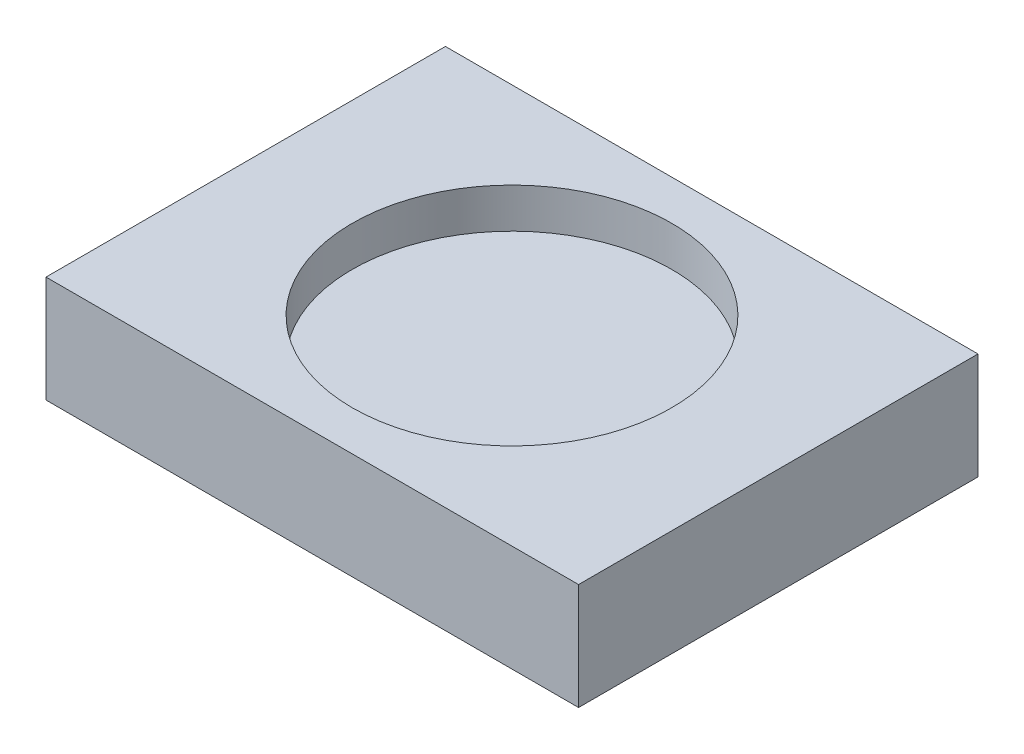
ISO-10303-21;
HEADER;
FILE_DESCRIPTION(('STEP AP214'),'2;1');
FILE_NAME('part.step','',(''),(''),'','','');
FILE_SCHEMA(('AUTOMOTIVE_DESIGN { 1 0 10303 214 1 1 1 1 }'));
ENDSEC;
DATA;
#1=APPLICATION_CONTEXT('core data for automotive mechanical design processes');
#2=APPLICATION_PROTOCOL_DEFINITION('international standard','automotive_design',2000,#1);
#3=PRODUCT_CONTEXT('',#1,'mechanical');
#4=PRODUCT('Part','Part','',(#3));
#5=PRODUCT_RELATED_PRODUCT_CATEGORY('part','',(#4));
#6=PRODUCT_DEFINITION_FORMATION('','',#4);
#7=PRODUCT_DEFINITION_CONTEXT('part definition',#1,'design');
#8=PRODUCT_DEFINITION('design','',#6,#7);
#9=PRODUCT_DEFINITION_SHAPE('','',#8);
#10=(LENGTH_UNIT() NAMED_UNIT(*) SI_UNIT(.MILLI.,.METRE.));
#11=(NAMED_UNIT(*) PLANE_ANGLE_UNIT() SI_UNIT($,.RADIAN.));
#12=(NAMED_UNIT(*) SI_UNIT($,.STERADIAN.) SOLID_ANGLE_UNIT());
#13=UNCERTAINTY_MEASURE_WITH_UNIT(LENGTH_MEASURE(1.E-05),#10,'distance_accuracy_value','');
#14=(GEOMETRIC_REPRESENTATION_CONTEXT(3) GLOBAL_UNCERTAINTY_ASSIGNED_CONTEXT((#13)) GLOBAL_UNIT_ASSIGNED_CONTEXT((#10,
#11,#12)) REPRESENTATION_CONTEXT('',''));
#15=CARTESIAN_POINT('',(0.,0.,0.));
#16=DIRECTION('',(0.,0.,1.));
#17=DIRECTION('',(1.,0.,0.));
#18=AXIS2_PLACEMENT_3D('',#15,#16,#17);
#19=CARTESIAN_POINT('',(100.,40.,-75.));
#20=DIRECTION('',(-1.,0.,0.));
#21=DIRECTION('',(0.,0.,1.));
#22=AXIS2_PLACEMENT_3D('',#19,#20,#21);
#23=PLANE('',#22);
#24=DIRECTION('',(0.,0.,-1.));
#25=VECTOR('',#24,1.);
#26=CARTESIAN_POINT('',(100.,0.,-75.));
#27=LINE('',#26,#25);
#28=CARTESIAN_POINT('',(100.,0.,75.));
#29=VERTEX_POINT('',#28);
#30=CARTESIAN_POINT('',(100.,0.,-75.));
#31=VERTEX_POINT('',#30);
#32=EDGE_CURVE('E98',#29,#31,#27,.T.);
#33=ORIENTED_EDGE('',*,*,#32,.T.);
#34=DIRECTION('',(0.,-1.,0.));
#35=VECTOR('',#34,1.);
#36=CARTESIAN_POINT('',(100.,40.,-75.));
#37=LINE('',#36,#35);
#38=CARTESIAN_POINT('',(100.,40.,-75.));
#39=VERTEX_POINT('',#38);
#40=EDGE_CURVE('E11',#39,#31,#37,.T.);
#41=ORIENTED_EDGE('',*,*,#40,.F.);
#42=DIRECTION('',(0.,0.,-1.));
#43=VECTOR('',#42,1.);
#44=CARTESIAN_POINT('',(100.,40.,-75.));
#45=LINE('',#44,#43);
#46=CARTESIAN_POINT('',(100.,40.,75.));
#47=VERTEX_POINT('',#46);
#48=EDGE_CURVE('E86',#47,#39,#45,.T.);
#49=ORIENTED_EDGE('',*,*,#48,.F.);
#50=DIRECTION('',(0.,-1.,0.));
#51=VECTOR('',#50,1.);
#52=CARTESIAN_POINT('',(100.,40.,75.));
#53=LINE('',#52,#51);
#54=EDGE_CURVE('E94',#47,#29,#53,.T.);
#55=ORIENTED_EDGE('',*,*,#54,.T.);
#56=EDGE_LOOP('',(#33,#41,#49,#55));
#57=FACE_BOUND('',#56,.T.);
#58=ADVANCED_FACE('F35',(#57),#23,.F.);
#59=CARTESIAN_POINT('',(-100.,40.,-75.));
#60=DIRECTION('',(0.,0.,1.));
#61=DIRECTION('',(1.,0.,0.));
#62=AXIS2_PLACEMENT_3D('',#59,#60,#61);
#63=PLANE('',#62);
#64=DIRECTION('',(-1.,0.,0.));
#65=VECTOR('',#64,1.);
#66=CARTESIAN_POINT('',(-100.,0.,-75.));
#67=LINE('',#66,#65);
#68=CARTESIAN_POINT('',(-100.,0.,-75.));
#69=VERTEX_POINT('',#68);
#70=EDGE_CURVE('E90',#31,#69,#67,.T.);
#71=ORIENTED_EDGE('',*,*,#70,.T.);
#72=DIRECTION('',(0.,-1.,0.));
#73=VECTOR('',#72,1.);
#74=CARTESIAN_POINT('',(-100.,40.,-75.));
#75=LINE('',#74,#73);
#76=CARTESIAN_POINT('',(-100.,40.,-75.));
#77=VERTEX_POINT('',#76);
#78=EDGE_CURVE('E43',#77,#69,#75,.T.);
#79=ORIENTED_EDGE('',*,*,#78,.F.);
#80=DIRECTION('',(-1.,0.,0.));
#81=VECTOR('',#80,1.);
#82=CARTESIAN_POINT('',(-100.,40.,-75.));
#83=LINE('',#82,#81);
#84=EDGE_CURVE('E81',#39,#77,#83,.T.);
#85=ORIENTED_EDGE('',*,*,#84,.F.);
#86=ORIENTED_EDGE('',*,*,#40,.T.);
#87=EDGE_LOOP('',(#71,#79,#85,#86));
#88=FACE_BOUND('',#87,.T.);
#89=ADVANCED_FACE('F89',(#88),#63,.F.);
#90=CARTESIAN_POINT('',(-100.,40.,-75.));
#91=DIRECTION('',(1.,0.,0.));
#92=DIRECTION('',(0.,0.,-1.));
#93=AXIS2_PLACEMENT_3D('',#90,#91,#92);
#94=PLANE('',#93);
#95=DIRECTION('',(0.,0.,1.));
#96=VECTOR('',#95,1.);
#97=CARTESIAN_POINT('',(-100.,0.,-75.));
#98=LINE('',#97,#96);
#99=CARTESIAN_POINT('',(-100.,0.,75.));
#100=VERTEX_POINT('',#99);
#101=EDGE_CURVE('E68',#69,#100,#98,.T.);
#102=ORIENTED_EDGE('',*,*,#101,.T.);
#103=DIRECTION('',(0.,-1.,0.));
#104=VECTOR('',#103,1.);
#105=CARTESIAN_POINT('',(-100.,40.,75.));
#106=LINE('',#105,#104);
#107=CARTESIAN_POINT('',(-100.,40.,75.));
#108=VERTEX_POINT('',#107);
#109=EDGE_CURVE('E91',#108,#100,#106,.T.);
#110=ORIENTED_EDGE('',*,*,#109,.F.);
#111=DIRECTION('',(0.,0.,1.));
#112=VECTOR('',#111,1.);
#113=CARTESIAN_POINT('',(-100.,40.,-75.));
#114=LINE('',#113,#112);
#115=EDGE_CURVE('E84',#77,#108,#114,.T.);
#116=ORIENTED_EDGE('',*,*,#115,.F.);
#117=ORIENTED_EDGE('',*,*,#78,.T.);
#118=EDGE_LOOP('',(#102,#110,#116,#117));
#119=FACE_BOUND('',#118,.T.);
#120=ADVANCED_FACE('F92',(#119),#94,.F.);
#121=CARTESIAN_POINT('',(-100.,40.,75.));
#122=DIRECTION('',(0.,0.,-1.));
#123=DIRECTION('',(-1.,0.,0.));
#124=AXIS2_PLACEMENT_3D('',#121,#122,#123);
#125=PLANE('',#124);
#126=DIRECTION('',(1.,0.,0.));
#127=VECTOR('',#126,1.);
#128=CARTESIAN_POINT('',(-100.,0.,75.));
#129=LINE('',#128,#127);
#130=EDGE_CURVE('E74',#100,#29,#129,.T.);
#131=ORIENTED_EDGE('',*,*,#130,.T.);
#132=ORIENTED_EDGE('',*,*,#54,.F.);
#133=DIRECTION('',(1.,0.,0.));
#134=VECTOR('',#133,1.);
#135=CARTESIAN_POINT('',(-100.,40.,75.));
#136=LINE('',#135,#134);
#137=EDGE_CURVE('E51',#108,#47,#136,.T.);
#138=ORIENTED_EDGE('',*,*,#137,.F.);
#139=ORIENTED_EDGE('',*,*,#109,.T.);
#140=EDGE_LOOP('',(#131,#132,#138,#139));
#141=FACE_BOUND('',#140,.T.);
#142=ADVANCED_FACE('F106',(#141),#125,.F.);
#143=CARTESIAN_POINT('',(0.,40.,0.));
#144=DIRECTION('',(0.,1.,0.));
#145=DIRECTION('',(0.,0.,1.));
#146=AXIS2_PLACEMENT_3D('',#143,#144,#145);
#147=PLANE('',#146);
#148=CARTESIAN_POINT('',(0.,40.,0.));
#149=DIRECTION('',(0.,1.,0.));
#150=DIRECTION('',(0.,0.,1.));
#151=AXIS2_PLACEMENT_3D('',#148,#149,#150);
#152=CIRCLE('',#151,60.);
#153=CARTESIAN_POINT('',(0.,40.,60.));
#154=VERTEX_POINT('',#153);
#155=EDGE_CURVE('E112',#154,#154,#152,.T.);
#156=ORIENTED_EDGE('',*,*,#155,.F.);
#157=EDGE_LOOP('',(#156));
#158=FACE_BOUND('',#157,.T.);
#159=ORIENTED_EDGE('',*,*,#48,.T.);
#160=ORIENTED_EDGE('',*,*,#84,.T.);
#161=ORIENTED_EDGE('',*,*,#115,.T.);
#162=ORIENTED_EDGE('',*,*,#137,.T.);
#163=EDGE_LOOP('',(#159,#160,#161,#162));
#164=FACE_BOUND('',#163,.T.);
#165=ADVANCED_FACE('F82',(#158,#164),#147,.T.);
#166=CARTESIAN_POINT('',(0.,0.,0.));
#167=DIRECTION('',(0.,1.,0.));
#168=DIRECTION('',(0.,0.,1.));
#169=AXIS2_PLACEMENT_3D('',#166,#167,#168);
#170=PLANE('',#169);
#171=ORIENTED_EDGE('',*,*,#32,.F.);
#172=ORIENTED_EDGE('',*,*,#130,.F.);
#173=ORIENTED_EDGE('',*,*,#101,.F.);
#174=ORIENTED_EDGE('',*,*,#70,.F.);
#175=EDGE_LOOP('',(#171,#172,#173,#174));
#176=FACE_BOUND('',#175,.T.);
#177=ADVANCED_FACE('F109',(#176),#170,.F.);
#178=CARTESIAN_POINT('',(0.,25.,0.));
#179=DIRECTION('',(0.,1.,0.));
#180=DIRECTION('',(0.,0.,1.));
#181=AXIS2_PLACEMENT_3D('',#178,#179,#180);
#182=CYLINDRICAL_SURFACE('',#181,60.);
#183=CARTESIAN_POINT('',(0.,25.,0.));
#184=DIRECTION('',(0.,1.,0.));
#185=DIRECTION('',(0.,0.,1.));
#186=AXIS2_PLACEMENT_3D('',#183,#184,#185);
#187=CIRCLE('',#186,60.);
#188=CARTESIAN_POINT('',(0.,25.,60.));
#189=VERTEX_POINT('',#188);
#190=EDGE_CURVE('E101',#189,#189,#187,.T.);
#191=ORIENTED_EDGE('',*,*,#190,.F.);
#192=EDGE_LOOP('',(#191));
#193=FACE_BOUND('',#192,.T.);
#194=ORIENTED_EDGE('',*,*,#155,.T.);
#195=EDGE_LOOP('',(#194));
#196=FACE_BOUND('',#195,.T.);
#197=ADVANCED_FACE('F120',(#193,#196),#182,.F.);
#198=CARTESIAN_POINT('',(0.,25.,0.));
#199=DIRECTION('',(0.,1.,0.));
#200=DIRECTION('',(0.,0.,1.));
#201=AXIS2_PLACEMENT_3D('',#198,#199,#200);
#202=PLANE('',#201);
#203=ORIENTED_EDGE('',*,*,#190,.T.);
#204=EDGE_LOOP('',(#203));
#205=FACE_BOUND('',#204,.T.);
#206=ADVANCED_FACE('F118',(#205),#202,.T.);
#207=CLOSED_SHELL('',(#58,#89,#120,#142,#165,#177,#197,#206));
#208=MANIFOLD_SOLID_BREP('B2',#207);
#209=ADVANCED_BREP_SHAPE_REPRESENTATION('',(#18,#208),#14);
#210=SHAPE_DEFINITION_REPRESENTATION(#9,#209);
ENDSEC;
END-ISO-10303-21;
